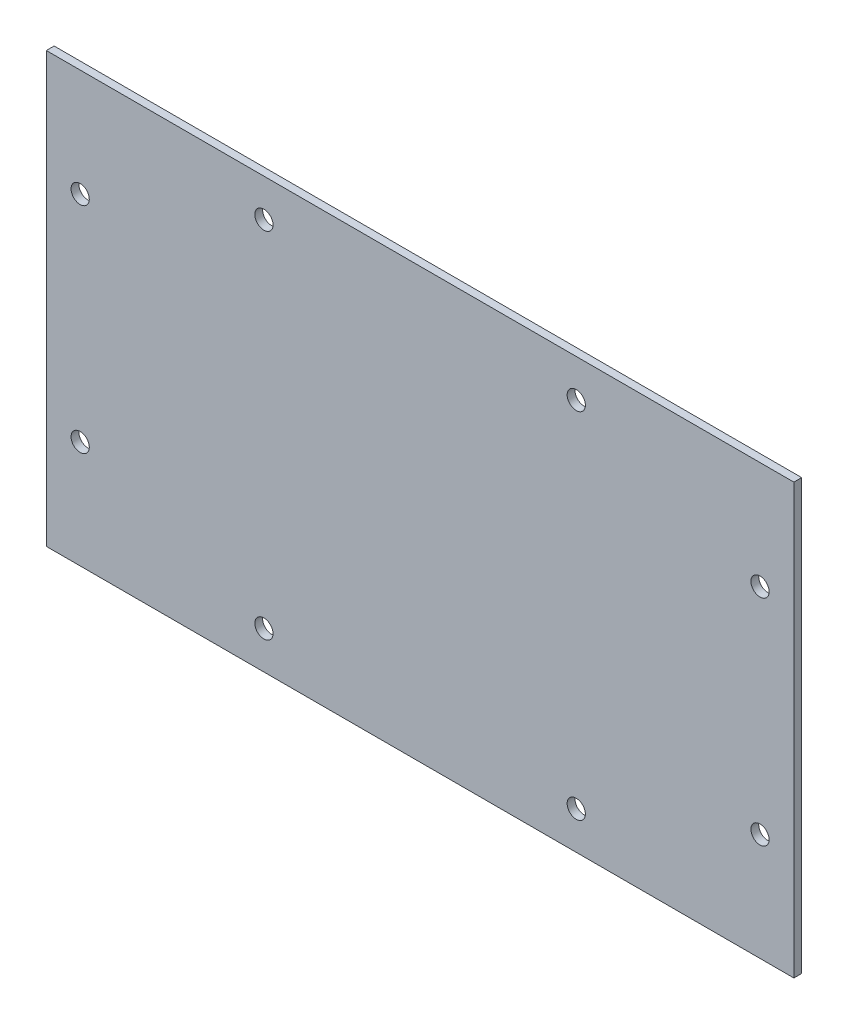
ISO-10303-21;
HEADER;
FILE_DESCRIPTION(('STEP AP214'),'2;1');
FILE_NAME('part.step','',(''),(''),'','','');
FILE_SCHEMA(('AUTOMOTIVE_DESIGN { 1 0 10303 214 1 1 1 1 }'));
ENDSEC;
DATA;
#1=APPLICATION_CONTEXT('core data for automotive mechanical design processes');
#2=APPLICATION_PROTOCOL_DEFINITION('international standard','automotive_design',2000,#1);
#3=PRODUCT_CONTEXT('',#1,'mechanical');
#4=PRODUCT('Part','Part','',(#3));
#5=PRODUCT_RELATED_PRODUCT_CATEGORY('part','',(#4));
#6=PRODUCT_DEFINITION_FORMATION('','',#4);
#7=PRODUCT_DEFINITION_CONTEXT('part definition',#1,'design');
#8=PRODUCT_DEFINITION('design','',#6,#7);
#9=PRODUCT_DEFINITION_SHAPE('','',#8);
#10=(LENGTH_UNIT() NAMED_UNIT(*) SI_UNIT(.MILLI.,.METRE.));
#11=(NAMED_UNIT(*) PLANE_ANGLE_UNIT() SI_UNIT($,.RADIAN.));
#12=(NAMED_UNIT(*) SI_UNIT($,.STERADIAN.) SOLID_ANGLE_UNIT());
#13=UNCERTAINTY_MEASURE_WITH_UNIT(LENGTH_MEASURE(1.E-05),#10,'distance_accuracy_value','');
#14=(GEOMETRIC_REPRESENTATION_CONTEXT(3) GLOBAL_UNCERTAINTY_ASSIGNED_CONTEXT((#13)) GLOBAL_UNIT_ASSIGNED_CONTEXT((#10,
#11,#12)) REPRESENTATION_CONTEXT('',''));
#15=CARTESIAN_POINT('',(0.,0.,0.));
#16=DIRECTION('',(0.,0.,1.));
#17=DIRECTION('',(1.,0.,0.));
#18=AXIS2_PLACEMENT_3D('',#15,#16,#17);
#19=CARTESIAN_POINT('',(0.,0.,3.));
#20=DIRECTION('',(0.,0.,1.));
#21=DIRECTION('',(1.,0.,0.));
#22=AXIS2_PLACEMENT_3D('',#19,#20,#21);
#23=PLANE('',#22);
#24=CARTESIAN_POINT('',(-60.,-68.,3.));
#25=DIRECTION('',(0.,0.,1.));
#26=DIRECTION('',(-1.,0.,0.));
#27=AXIS2_PLACEMENT_3D('',#24,#25,#26);
#28=CIRCLE('',#27,3.5);
#29=CARTESIAN_POINT('',(-63.5,-68.,3.));
#30=VERTEX_POINT('',#29);
#31=EDGE_CURVE('E179',#30,#30,#28,.T.);
#32=ORIENTED_EDGE('',*,*,#31,.F.);
#33=EDGE_LOOP('',(#32));
#34=FACE_BOUND('',#33,.T.);
#35=CARTESIAN_POINT('',(60.,-68.,3.));
#36=DIRECTION('',(0.,0.,1.));
#37=DIRECTION('',(1.,0.,0.));
#38=AXIS2_PLACEMENT_3D('',#35,#36,#37);
#39=CIRCLE('',#38,3.50000000000001);
#40=CARTESIAN_POINT('',(63.5,-68.,3.));
#41=VERTEX_POINT('',#40);
#42=EDGE_CURVE('E187',#41,#41,#39,.T.);
#43=ORIENTED_EDGE('',*,*,#42,.F.);
#44=EDGE_LOOP('',(#43));
#45=FACE_BOUND('',#44,.T.);
#46=CARTESIAN_POINT('',(60.,68.,3.));
#47=DIRECTION('',(0.,0.,1.));
#48=DIRECTION('',(-1.,0.,0.));
#49=AXIS2_PLACEMENT_3D('',#46,#47,#48);
#50=CIRCLE('',#49,3.50000000000001);
#51=CARTESIAN_POINT('',(56.5,68.,3.));
#52=VERTEX_POINT('',#51);
#53=EDGE_CURVE('E171',#52,#52,#50,.T.);
#54=ORIENTED_EDGE('',*,*,#53,.F.);
#55=EDGE_LOOP('',(#54));
#56=FACE_BOUND('',#55,.T.);
#57=CARTESIAN_POINT('',(-60.,68.,3.));
#58=DIRECTION('',(0.,0.,1.));
#59=DIRECTION('',(1.,0.,0.));
#60=AXIS2_PLACEMENT_3D('',#57,#58,#59);
#61=CIRCLE('',#60,3.5);
#62=CARTESIAN_POINT('',(-56.5,68.,3.));
#63=VERTEX_POINT('',#62);
#64=EDGE_CURVE('E167',#63,#63,#61,.T.);
#65=ORIENTED_EDGE('',*,*,#64,.F.);
#66=EDGE_LOOP('',(#65));
#67=FACE_BOUND('',#66,.T.);
#68=CARTESIAN_POINT('',(130.600000000622,-41.2500000000001,3.));
#69=DIRECTION('',(0.,0.,1.));
#70=DIRECTION('',(1.,0.,0.));
#71=AXIS2_PLACEMENT_3D('',#68,#69,#70);
#72=CIRCLE('',#71,3.49999999999999);
#73=CARTESIAN_POINT('',(134.100000000622,-41.2500000000001,3.));
#74=VERTEX_POINT('',#73);
#75=EDGE_CURVE('E147',#74,#74,#72,.T.);
#76=ORIENTED_EDGE('',*,*,#75,.F.);
#77=EDGE_LOOP('',(#76));
#78=FACE_BOUND('',#77,.T.);
#79=CARTESIAN_POINT('',(-130.600000000622,41.2500000000001,3.));
#80=DIRECTION('',(0.,0.,1.));
#81=DIRECTION('',(1.,0.,0.));
#82=AXIS2_PLACEMENT_3D('',#79,#80,#81);
#83=CIRCLE('',#82,3.49999999999999);
#84=CARTESIAN_POINT('',(-127.100000000622,41.2500000000001,3.));
#85=VERTEX_POINT('',#84);
#86=EDGE_CURVE('E117',#85,#85,#83,.T.);
#87=ORIENTED_EDGE('',*,*,#86,.F.);
#88=EDGE_LOOP('',(#87));
#89=FACE_BOUND('',#88,.T.);
#90=DIRECTION('',(0.,-1.,0.));
#91=VECTOR('',#90,1.);
#92=CARTESIAN_POINT('',(-143.600000000622,82.5,3.));
#93=LINE('',#92,#91);
#94=CARTESIAN_POINT('',(-143.600000000622,82.5,3.));
#95=VERTEX_POINT('',#94);
#96=CARTESIAN_POINT('',(-143.600000000622,-82.5,3.));
#97=VERTEX_POINT('',#96);
#98=EDGE_CURVE('E97',#95,#97,#93,.T.);
#99=ORIENTED_EDGE('',*,*,#98,.T.);
#100=DIRECTION('',(1.,0.,0.));
#101=VECTOR('',#100,1.);
#102=CARTESIAN_POINT('',(-143.600000000622,-82.5,3.));
#103=LINE('',#102,#101);
#104=CARTESIAN_POINT('',(143.600000000622,-82.5000000000001,3.));
#105=VERTEX_POINT('',#104);
#106=EDGE_CURVE('E92',#97,#105,#103,.T.);
#107=ORIENTED_EDGE('',*,*,#106,.T.);
#108=DIRECTION('',(0.,1.,0.));
#109=VECTOR('',#108,1.);
#110=CARTESIAN_POINT('',(143.600000000622,82.5000000000001,3.));
#111=LINE('',#110,#109);
#112=CARTESIAN_POINT('',(143.600000000622,82.5000000000001,3.));
#113=VERTEX_POINT('',#112);
#114=EDGE_CURVE('E95',#105,#113,#111,.T.);
#115=ORIENTED_EDGE('',*,*,#114,.T.);
#116=DIRECTION('',(-1.,0.,0.));
#117=VECTOR('',#116,1.);
#118=CARTESIAN_POINT('',(-143.600000000622,82.5,3.));
#119=LINE('',#118,#117);
#120=EDGE_CURVE('E62',#113,#95,#119,.T.);
#121=ORIENTED_EDGE('',*,*,#120,.T.);
#122=EDGE_LOOP('',(#99,#107,#115,#121));
#123=FACE_BOUND('',#122,.T.);
#124=CARTESIAN_POINT('',(-130.600000000622,-41.2500000000001,3.));
#125=DIRECTION('',(0.,0.,1.));
#126=DIRECTION('',(-1.,0.,0.));
#127=AXIS2_PLACEMENT_3D('',#124,#125,#126);
#128=CIRCLE('',#127,3.49999999999999);
#129=CARTESIAN_POINT('',(-134.100000000622,-41.2500000000001,3.));
#130=VERTEX_POINT('',#129);
#131=EDGE_CURVE('E139',#130,#130,#128,.T.);
#132=ORIENTED_EDGE('',*,*,#131,.F.);
#133=EDGE_LOOP('',(#132));
#134=FACE_BOUND('',#133,.T.);
#135=CARTESIAN_POINT('',(130.600000000622,41.2500000000001,3.));
#136=DIRECTION('',(0.,0.,1.));
#137=DIRECTION('',(-1.,0.,0.));
#138=AXIS2_PLACEMENT_3D('',#135,#136,#137);
#139=CIRCLE('',#138,3.49999999999999);
#140=CARTESIAN_POINT('',(127.100000000622,41.2500000000001,3.));
#141=VERTEX_POINT('',#140);
#142=EDGE_CURVE('E155',#141,#141,#139,.T.);
#143=ORIENTED_EDGE('',*,*,#142,.F.);
#144=EDGE_LOOP('',(#143));
#145=FACE_BOUND('',#144,.T.);
#146=ADVANCED_FACE('F44',(#34,#45,#56,#67,#78,#89,#123,#134,#145),#23,.T.);
#147=CARTESIAN_POINT('',(0.,0.,0.));
#148=DIRECTION('',(0.,0.,1.));
#149=DIRECTION('',(1.,0.,0.));
#150=AXIS2_PLACEMENT_3D('',#147,#148,#149);
#151=PLANE('',#150);
#152=CARTESIAN_POINT('',(-60.,-68.,0.));
#153=DIRECTION('',(0.,0.,1.));
#154=DIRECTION('',(-1.,0.,0.));
#155=AXIS2_PLACEMENT_3D('',#152,#153,#154);
#156=CIRCLE('',#155,3.5);
#157=CARTESIAN_POINT('',(-63.5,-68.,0.));
#158=VERTEX_POINT('',#157);
#159=EDGE_CURVE('E175',#158,#158,#156,.T.);
#160=ORIENTED_EDGE('',*,*,#159,.T.);
#161=EDGE_LOOP('',(#160));
#162=FACE_BOUND('',#161,.T.);
#163=CARTESIAN_POINT('',(60.,-68.,0.));
#164=DIRECTION('',(0.,0.,1.));
#165=DIRECTION('',(1.,0.,0.));
#166=AXIS2_PLACEMENT_3D('',#163,#164,#165);
#167=CIRCLE('',#166,3.50000000000001);
#168=CARTESIAN_POINT('',(63.5,-68.,0.));
#169=VERTEX_POINT('',#168);
#170=EDGE_CURVE('E183',#169,#169,#167,.T.);
#171=ORIENTED_EDGE('',*,*,#170,.T.);
#172=EDGE_LOOP('',(#171));
#173=FACE_BOUND('',#172,.T.);
#174=CARTESIAN_POINT('',(60.,68.,0.));
#175=DIRECTION('',(0.,0.,1.));
#176=DIRECTION('',(-1.,0.,0.));
#177=AXIS2_PLACEMENT_3D('',#174,#175,#176);
#178=CIRCLE('',#177,3.50000000000001);
#179=CARTESIAN_POINT('',(56.5,68.,0.));
#180=VERTEX_POINT('',#179);
#181=EDGE_CURVE('E191',#180,#180,#178,.T.);
#182=ORIENTED_EDGE('',*,*,#181,.T.);
#183=EDGE_LOOP('',(#182));
#184=FACE_BOUND('',#183,.T.);
#185=CARTESIAN_POINT('',(-60.,68.,0.));
#186=DIRECTION('',(0.,0.,1.));
#187=DIRECTION('',(1.,0.,0.));
#188=AXIS2_PLACEMENT_3D('',#185,#186,#187);
#189=CIRCLE('',#188,3.5);
#190=CARTESIAN_POINT('',(-56.5,68.,0.));
#191=VERTEX_POINT('',#190);
#192=EDGE_CURVE('E163',#191,#191,#189,.T.);
#193=ORIENTED_EDGE('',*,*,#192,.T.);
#194=EDGE_LOOP('',(#193));
#195=FACE_BOUND('',#194,.T.);
#196=DIRECTION('',(0.,-1.,0.));
#197=VECTOR('',#196,1.);
#198=CARTESIAN_POINT('',(-143.600000000622,82.5,0.));
#199=LINE('',#198,#197);
#200=CARTESIAN_POINT('',(-143.600000000622,82.5,0.));
#201=VERTEX_POINT('',#200);
#202=CARTESIAN_POINT('',(-143.600000000622,-82.5,0.));
#203=VERTEX_POINT('',#202);
#204=EDGE_CURVE('E113',#201,#203,#199,.T.);
#205=ORIENTED_EDGE('',*,*,#204,.F.);
#206=DIRECTION('',(-1.,0.,0.));
#207=VECTOR('',#206,1.);
#208=CARTESIAN_POINT('',(-143.600000000622,82.5,0.));
#209=LINE('',#208,#207);
#210=CARTESIAN_POINT('',(143.600000000622,82.5000000000001,0.));
#211=VERTEX_POINT('',#210);
#212=EDGE_CURVE('E85',#211,#201,#209,.T.);
#213=ORIENTED_EDGE('',*,*,#212,.F.);
#214=DIRECTION('',(0.,1.,0.));
#215=VECTOR('',#214,1.);
#216=CARTESIAN_POINT('',(143.600000000622,82.5000000000001,0.));
#217=LINE('',#216,#215);
#218=CARTESIAN_POINT('',(143.600000000622,-82.5000000000001,0.));
#219=VERTEX_POINT('',#218);
#220=EDGE_CURVE('E79',#219,#211,#217,.T.);
#221=ORIENTED_EDGE('',*,*,#220,.F.);
#222=DIRECTION('',(1.,0.,0.));
#223=VECTOR('',#222,1.);
#224=CARTESIAN_POINT('',(-143.600000000622,-82.5,0.));
#225=LINE('',#224,#223);
#226=EDGE_CURVE('E102',#203,#219,#225,.T.);
#227=ORIENTED_EDGE('',*,*,#226,.F.);
#228=EDGE_LOOP('',(#205,#213,#221,#227));
#229=FACE_BOUND('',#228,.T.);
#230=CARTESIAN_POINT('',(-130.600000000622,41.2500000000001,0.));
#231=DIRECTION('',(0.,0.,1.));
#232=DIRECTION('',(1.,0.,0.));
#233=AXIS2_PLACEMENT_3D('',#230,#231,#232);
#234=CIRCLE('',#233,3.49999999999999);
#235=CARTESIAN_POINT('',(-127.100000000622,41.2500000000001,0.));
#236=VERTEX_POINT('',#235);
#237=EDGE_CURVE('E135',#236,#236,#234,.T.);
#238=ORIENTED_EDGE('',*,*,#237,.T.);
#239=EDGE_LOOP('',(#238));
#240=FACE_BOUND('',#239,.T.);
#241=CARTESIAN_POINT('',(-130.600000000622,-41.2500000000001,0.));
#242=DIRECTION('',(0.,0.,1.));
#243=DIRECTION('',(-1.,0.,0.));
#244=AXIS2_PLACEMENT_3D('',#241,#242,#243);
#245=CIRCLE('',#244,3.49999999999999);
#246=CARTESIAN_POINT('',(-134.100000000622,-41.2500000000001,0.));
#247=VERTEX_POINT('',#246);
#248=EDGE_CURVE('E143',#247,#247,#245,.T.);
#249=ORIENTED_EDGE('',*,*,#248,.T.);
#250=EDGE_LOOP('',(#249));
#251=FACE_BOUND('',#250,.T.);
#252=CARTESIAN_POINT('',(130.600000000622,-41.2500000000001,0.));
#253=DIRECTION('',(0.,0.,1.));
#254=DIRECTION('',(1.,0.,0.));
#255=AXIS2_PLACEMENT_3D('',#252,#253,#254);
#256=CIRCLE('',#255,3.49999999999999);
#257=CARTESIAN_POINT('',(134.100000000622,-41.2500000000001,0.));
#258=VERTEX_POINT('',#257);
#259=EDGE_CURVE('E151',#258,#258,#256,.T.);
#260=ORIENTED_EDGE('',*,*,#259,.T.);
#261=EDGE_LOOP('',(#260));
#262=FACE_BOUND('',#261,.T.);
#263=CARTESIAN_POINT('',(130.600000000622,41.2500000000001,0.));
#264=DIRECTION('',(0.,0.,1.));
#265=DIRECTION('',(-1.,0.,0.));
#266=AXIS2_PLACEMENT_3D('',#263,#264,#265);
#267=CIRCLE('',#266,3.49999999999999);
#268=CARTESIAN_POINT('',(127.100000000622,41.2500000000001,0.));
#269=VERTEX_POINT('',#268);
#270=EDGE_CURVE('E159',#269,#269,#267,.T.);
#271=ORIENTED_EDGE('',*,*,#270,.T.);
#272=EDGE_LOOP('',(#271));
#273=FACE_BOUND('',#272,.T.);
#274=ADVANCED_FACE('F130',(#162,#173,#184,#195,#229,#240,#251,#262,#273),#151,.F.);
#275=CARTESIAN_POINT('',(-143.600000000622,82.5,3.));
#276=DIRECTION('',(1.,0.,0.));
#277=DIRECTION('',(0.,0.,-1.));
#278=AXIS2_PLACEMENT_3D('',#275,#276,#277);
#279=PLANE('',#278);
#280=ORIENTED_EDGE('',*,*,#204,.T.);
#281=DIRECTION('',(0.,0.,-1.));
#282=VECTOR('',#281,1.);
#283=CARTESIAN_POINT('',(-143.600000000622,-82.5,3.));
#284=LINE('',#283,#282);
#285=EDGE_CURVE('E11',#97,#203,#284,.T.);
#286=ORIENTED_EDGE('',*,*,#285,.F.);
#287=ORIENTED_EDGE('',*,*,#98,.F.);
#288=DIRECTION('',(0.,0.,-1.));
#289=VECTOR('',#288,1.);
#290=CARTESIAN_POINT('',(-143.600000000622,82.5,3.));
#291=LINE('',#290,#289);
#292=EDGE_CURVE('E109',#95,#201,#291,.T.);
#293=ORIENTED_EDGE('',*,*,#292,.T.);
#294=EDGE_LOOP('',(#280,#286,#287,#293));
#295=FACE_BOUND('',#294,.T.);
#296=ADVANCED_FACE('F46',(#295),#279,.F.);
#297=CARTESIAN_POINT('',(-143.600000000622,-82.5,3.));
#298=DIRECTION('',(0.,1.,0.));
#299=DIRECTION('',(-1.,0.,0.));
#300=AXIS2_PLACEMENT_3D('',#297,#298,#299);
#301=PLANE('',#300);
#302=ORIENTED_EDGE('',*,*,#226,.T.);
#303=DIRECTION('',(0.,0.,-1.));
#304=VECTOR('',#303,1.);
#305=CARTESIAN_POINT('',(143.600000000622,-82.5000000000001,3.));
#306=LINE('',#305,#304);
#307=EDGE_CURVE('E54',#105,#219,#306,.T.);
#308=ORIENTED_EDGE('',*,*,#307,.F.);
#309=ORIENTED_EDGE('',*,*,#106,.F.);
#310=ORIENTED_EDGE('',*,*,#285,.T.);
#311=EDGE_LOOP('',(#302,#308,#309,#310));
#312=FACE_BOUND('',#311,.T.);
#313=ADVANCED_FACE('F101',(#312),#301,.F.);
#314=CARTESIAN_POINT('',(143.600000000622,82.5000000000001,3.));
#315=DIRECTION('',(-1.,0.,0.));
#316=DIRECTION('',(0.,0.,1.));
#317=AXIS2_PLACEMENT_3D('',#314,#315,#316);
#318=PLANE('',#317);
#319=ORIENTED_EDGE('',*,*,#220,.T.);
#320=DIRECTION('',(0.,0.,-1.));
#321=VECTOR('',#320,1.);
#322=CARTESIAN_POINT('',(143.600000000622,82.5000000000001,3.));
#323=LINE('',#322,#321);
#324=EDGE_CURVE('E104',#113,#211,#323,.T.);
#325=ORIENTED_EDGE('',*,*,#324,.F.);
#326=ORIENTED_EDGE('',*,*,#114,.F.);
#327=ORIENTED_EDGE('',*,*,#307,.T.);
#328=EDGE_LOOP('',(#319,#325,#326,#327));
#329=FACE_BOUND('',#328,.T.);
#330=ADVANCED_FACE('F105',(#329),#318,.F.);
#331=CARTESIAN_POINT('',(-143.600000000622,82.5,3.));
#332=DIRECTION('',(0.,-1.,0.));
#333=DIRECTION('',(1.,0.,0.));
#334=AXIS2_PLACEMENT_3D('',#331,#332,#333);
#335=PLANE('',#334);
#336=ORIENTED_EDGE('',*,*,#212,.T.);
#337=ORIENTED_EDGE('',*,*,#292,.F.);
#338=ORIENTED_EDGE('',*,*,#120,.F.);
#339=ORIENTED_EDGE('',*,*,#324,.T.);
#340=EDGE_LOOP('',(#336,#337,#338,#339));
#341=FACE_BOUND('',#340,.T.);
#342=ADVANCED_FACE('F127',(#341),#335,.F.);
#343=CARTESIAN_POINT('',(-130.600000000622,41.2500000000001,3.));
#344=DIRECTION('',(0.,0.,-1.));
#345=DIRECTION('',(-1.,0.,0.));
#346=AXIS2_PLACEMENT_3D('',#343,#344,#345);
#347=CYLINDRICAL_SURFACE('',#346,3.49999999999999);
#348=ORIENTED_EDGE('',*,*,#86,.T.);
#349=EDGE_LOOP('',(#348));
#350=FACE_BOUND('',#349,.T.);
#351=ORIENTED_EDGE('',*,*,#237,.F.);
#352=EDGE_LOOP('',(#351));
#353=FACE_BOUND('',#352,.T.);
#354=ADVANCED_FACE('F211',(#350,#353),#347,.F.);
#355=CARTESIAN_POINT('',(-130.600000000622,-41.2500000000001,3.));
#356=DIRECTION('',(0.,0.,-1.));
#357=DIRECTION('',(-1.,0.,0.));
#358=AXIS2_PLACEMENT_3D('',#355,#356,#357);
#359=CYLINDRICAL_SURFACE('',#358,3.49999999999999);
#360=ORIENTED_EDGE('',*,*,#131,.T.);
#361=EDGE_LOOP('',(#360));
#362=FACE_BOUND('',#361,.T.);
#363=ORIENTED_EDGE('',*,*,#248,.F.);
#364=EDGE_LOOP('',(#363));
#365=FACE_BOUND('',#364,.T.);
#366=ADVANCED_FACE('F214',(#362,#365),#359,.F.);
#367=CARTESIAN_POINT('',(130.600000000622,-41.2500000000001,3.));
#368=DIRECTION('',(0.,0.,-1.));
#369=DIRECTION('',(-1.,0.,0.));
#370=AXIS2_PLACEMENT_3D('',#367,#368,#369);
#371=CYLINDRICAL_SURFACE('',#370,3.49999999999999);
#372=ORIENTED_EDGE('',*,*,#75,.T.);
#373=EDGE_LOOP('',(#372));
#374=FACE_BOUND('',#373,.T.);
#375=ORIENTED_EDGE('',*,*,#259,.F.);
#376=EDGE_LOOP('',(#375));
#377=FACE_BOUND('',#376,.T.);
#378=ADVANCED_FACE('F230',(#374,#377),#371,.F.);
#379=CARTESIAN_POINT('',(130.600000000622,41.2500000000001,3.));
#380=DIRECTION('',(0.,0.,-1.));
#381=DIRECTION('',(-1.,0.,0.));
#382=AXIS2_PLACEMENT_3D('',#379,#380,#381);
#383=CYLINDRICAL_SURFACE('',#382,3.49999999999999);
#384=ORIENTED_EDGE('',*,*,#142,.T.);
#385=EDGE_LOOP('',(#384));
#386=FACE_BOUND('',#385,.T.);
#387=ORIENTED_EDGE('',*,*,#270,.F.);
#388=EDGE_LOOP('',(#387));
#389=FACE_BOUND('',#388,.T.);
#390=ADVANCED_FACE('F227',(#386,#389),#383,.F.);
#391=CARTESIAN_POINT('',(-60.,68.,0.));
#392=DIRECTION('',(0.,0.,1.));
#393=DIRECTION('',(1.,0.,0.));
#394=AXIS2_PLACEMENT_3D('',#391,#392,#393);
#395=CYLINDRICAL_SURFACE('',#394,3.5);
#396=ORIENTED_EDGE('',*,*,#192,.F.);
#397=EDGE_LOOP('',(#396));
#398=FACE_BOUND('',#397,.T.);
#399=ORIENTED_EDGE('',*,*,#64,.T.);
#400=EDGE_LOOP('',(#399));
#401=FACE_BOUND('',#400,.T.);
#402=ADVANCED_FACE('F229',(#398,#401),#395,.F.);
#403=CARTESIAN_POINT('',(60.,68.,0.));
#404=DIRECTION('',(0.,0.,1.));
#405=DIRECTION('',(1.,0.,0.));
#406=AXIS2_PLACEMENT_3D('',#403,#404,#405);
#407=CYLINDRICAL_SURFACE('',#406,3.50000000000001);
#408=ORIENTED_EDGE('',*,*,#181,.F.);
#409=EDGE_LOOP('',(#408));
#410=FACE_BOUND('',#409,.T.);
#411=ORIENTED_EDGE('',*,*,#53,.T.);
#412=EDGE_LOOP('',(#411));
#413=FACE_BOUND('',#412,.T.);
#414=ADVANCED_FACE('F199',(#410,#413),#407,.F.);
#415=CARTESIAN_POINT('',(60.,-68.,0.));
#416=DIRECTION('',(0.,0.,1.));
#417=DIRECTION('',(1.,0.,0.));
#418=AXIS2_PLACEMENT_3D('',#415,#416,#417);
#419=CYLINDRICAL_SURFACE('',#418,3.50000000000001);
#420=ORIENTED_EDGE('',*,*,#170,.F.);
#421=EDGE_LOOP('',(#420));
#422=FACE_BOUND('',#421,.T.);
#423=ORIENTED_EDGE('',*,*,#42,.T.);
#424=EDGE_LOOP('',(#423));
#425=FACE_BOUND('',#424,.T.);
#426=ADVANCED_FACE('F314',(#422,#425),#419,.F.);
#427=CARTESIAN_POINT('',(-60.,-68.,0.));
#428=DIRECTION('',(0.,0.,1.));
#429=DIRECTION('',(1.,0.,0.));
#430=AXIS2_PLACEMENT_3D('',#427,#428,#429);
#431=CYLINDRICAL_SURFACE('',#430,3.5);
#432=ORIENTED_EDGE('',*,*,#159,.F.);
#433=EDGE_LOOP('',(#432));
#434=FACE_BOUND('',#433,.T.);
#435=ORIENTED_EDGE('',*,*,#31,.T.);
#436=EDGE_LOOP('',(#435));
#437=FACE_BOUND('',#436,.T.);
#438=ADVANCED_FACE('F324',(#434,#437),#431,.F.);
#439=CLOSED_SHELL('',(#146,#274,#296,#313,#330,#342,#354,#366,#378,#390,#402,#414,#426,#438));
#440=MANIFOLD_SOLID_BREP('B2',#439);
#441=ADVANCED_BREP_SHAPE_REPRESENTATION('',(#18,#440),#14);
#442=SHAPE_DEFINITION_REPRESENTATION(#9,#441);
ENDSEC;
END-ISO-10303-21;
